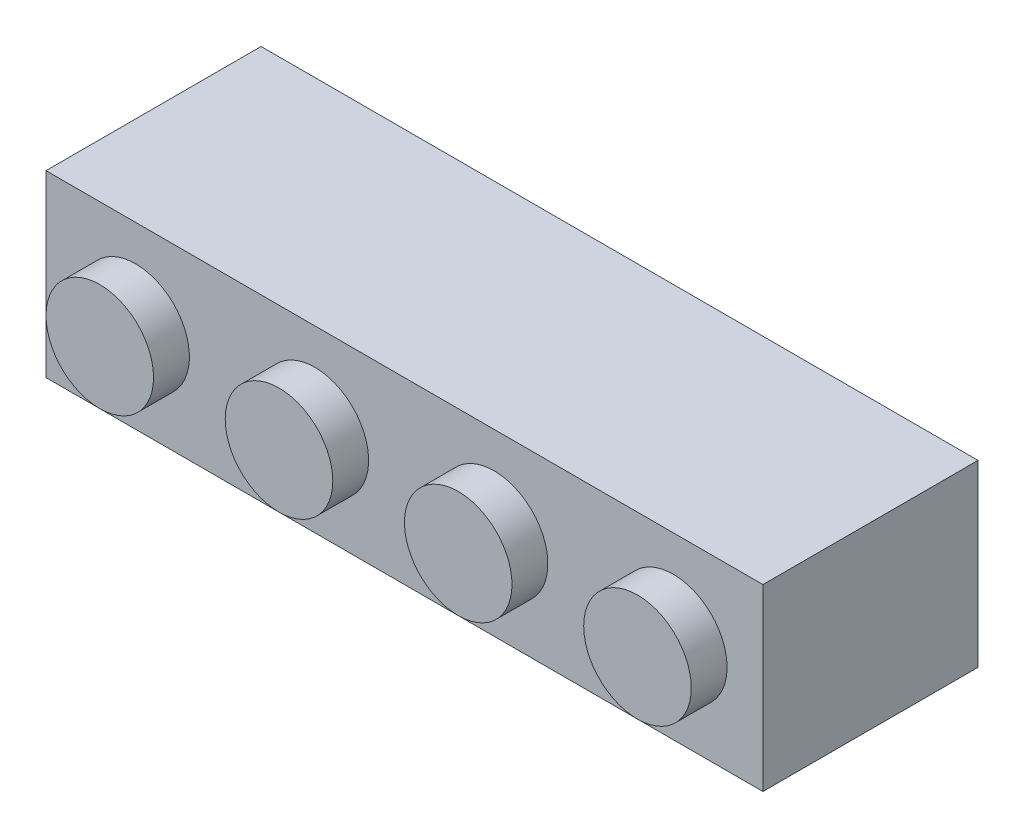
ISO-10303-21;
HEADER;
FILE_DESCRIPTION(('STEP AP214'),'2;1');
FILE_NAME('part.step','',(''),(''),'','','');
FILE_SCHEMA(('AUTOMOTIVE_DESIGN { 1 0 10303 214 1 1 1 1 }'));
ENDSEC;
DATA;
#1=APPLICATION_CONTEXT('core data for automotive mechanical design processes');
#2=APPLICATION_PROTOCOL_DEFINITION('international standard','automotive_design',2000,#1);
#3=PRODUCT_CONTEXT('',#1,'mechanical');
#4=PRODUCT('Part','Part','',(#3));
#5=PRODUCT_RELATED_PRODUCT_CATEGORY('part','',(#4));
#6=PRODUCT_DEFINITION_FORMATION('','',#4);
#7=PRODUCT_DEFINITION_CONTEXT('part definition',#1,'design');
#8=PRODUCT_DEFINITION('design','',#6,#7);
#9=PRODUCT_DEFINITION_SHAPE('','',#8);
#10=(LENGTH_UNIT() NAMED_UNIT(*) SI_UNIT(.MILLI.,.METRE.));
#11=(NAMED_UNIT(*) PLANE_ANGLE_UNIT() SI_UNIT($,.RADIAN.));
#12=(NAMED_UNIT(*) SI_UNIT($,.STERADIAN.) SOLID_ANGLE_UNIT());
#13=UNCERTAINTY_MEASURE_WITH_UNIT(LENGTH_MEASURE(1.E-05),#10,'distance_accuracy_value','');
#14=(GEOMETRIC_REPRESENTATION_CONTEXT(3) GLOBAL_UNCERTAINTY_ASSIGNED_CONTEXT((#13)) GLOBAL_UNIT_ASSIGNED_CONTEXT((#10,
#11,#12)) REPRESENTATION_CONTEXT('',''));
#15=CARTESIAN_POINT('',(0.,0.,0.));
#16=DIRECTION('',(0.,0.,1.));
#17=DIRECTION('',(1.,0.,0.));
#18=AXIS2_PLACEMENT_3D('',#15,#16,#17);
#19=CARTESIAN_POINT('',(0.,0.,8.));
#20=DIRECTION('',(0.,0.,-1.));
#21=DIRECTION('',(-1.,0.,0.));
#22=AXIS2_PLACEMENT_3D('',#19,#20,#21);
#23=PLANE('',#22);
#24=CARTESIAN_POINT('',(16.,4.,8.));
#25=DIRECTION('',(0.,0.,-1.));
#26=DIRECTION('',(-1.,0.,0.));
#27=AXIS2_PLACEMENT_3D('',#24,#25,#26);
#28=CIRCLE('',#27,1.6);
#29=CARTESIAN_POINT('',(14.4,4.,8.));
#30=VERTEX_POINT('',#29);
#31=EDGE_CURVE('E516',#30,#30,#28,.T.);
#32=ORIENTED_EDGE('',*,*,#31,.F.);
#33=EDGE_LOOP('',(#32));
#34=FACE_BOUND('',#33,.T.);
#35=CARTESIAN_POINT('',(28.,4.,8.));
#36=DIRECTION('',(0.,0.,-1.));
#37=DIRECTION('',(-1.,0.,0.));
#38=AXIS2_PLACEMENT_3D('',#35,#36,#37);
#39=CIRCLE('',#38,0.800000000000001);
#40=CARTESIAN_POINT('',(27.2,4.,8.));
#41=VERTEX_POINT('',#40);
#42=EDGE_CURVE('E141',#41,#41,#39,.F.);
#43=ORIENTED_EDGE('',*,*,#42,.T.);
#44=EDGE_LOOP('',(#43));
#45=FACE_BOUND('',#44,.T.);
#46=CARTESIAN_POINT('',(20.,4.,8.));
#47=DIRECTION('',(0.,0.,-1.));
#48=DIRECTION('',(-1.,0.,0.));
#49=AXIS2_PLACEMENT_3D('',#46,#47,#48);
#50=CIRCLE('',#49,0.800000000000001);
#51=CARTESIAN_POINT('',(19.2,4.,8.));
#52=VERTEX_POINT('',#51);
#53=EDGE_CURVE('E136',#52,#52,#50,.F.);
#54=ORIENTED_EDGE('',*,*,#53,.T.);
#55=EDGE_LOOP('',(#54));
#56=FACE_BOUND('',#55,.T.);
#57=CARTESIAN_POINT('',(12.,4.,8.));
#58=DIRECTION('',(0.,0.,-1.));
#59=DIRECTION('',(-1.,0.,0.));
#60=AXIS2_PLACEMENT_3D('',#57,#58,#59);
#61=CIRCLE('',#60,0.800000000000001);
#62=CARTESIAN_POINT('',(11.2,4.,8.));
#63=VERTEX_POINT('',#62);
#64=EDGE_CURVE('E133',#63,#63,#61,.F.);
#65=ORIENTED_EDGE('',*,*,#64,.T.);
#66=EDGE_LOOP('',(#65));
#67=FACE_BOUND('',#66,.T.);
#68=DIRECTION('',(0.,-1.,0.));
#69=VECTOR('',#68,1.);
#70=CARTESIAN_POINT('',(1.6,0.,8.));
#71=LINE('',#70,#69);
#72=CARTESIAN_POINT('',(1.6,6.4,8.));
#73=VERTEX_POINT('',#72);
#74=CARTESIAN_POINT('',(1.6,1.6,8.));
#75=VERTEX_POINT('',#74);
#76=EDGE_CURVE('E119',#73,#75,#71,.T.);
#77=ORIENTED_EDGE('',*,*,#76,.F.);
#78=DIRECTION('',(-1.,0.,0.));
#79=VECTOR('',#78,1.);
#80=CARTESIAN_POINT('',(0.,6.4,8.));
#81=LINE('',#80,#79);
#82=CARTESIAN_POINT('',(30.4,6.4,8.));
#83=VERTEX_POINT('',#82);
#84=EDGE_CURVE('E127',#83,#73,#81,.T.);
#85=ORIENTED_EDGE('',*,*,#84,.F.);
#86=DIRECTION('',(0.,1.,0.));
#87=VECTOR('',#86,1.);
#88=CARTESIAN_POINT('',(30.4,0.,8.));
#89=LINE('',#88,#87);
#90=CARTESIAN_POINT('',(30.4,1.6,8.));
#91=VERTEX_POINT('',#90);
#92=EDGE_CURVE('E118',#91,#83,#89,.T.);
#93=ORIENTED_EDGE('',*,*,#92,.F.);
#94=DIRECTION('',(1.,0.,0.));
#95=VECTOR('',#94,1.);
#96=CARTESIAN_POINT('',(0.,1.6,8.));
#97=LINE('',#96,#95);
#98=EDGE_CURVE('E108',#75,#91,#97,.T.);
#99=ORIENTED_EDGE('',*,*,#98,.F.);
#100=EDGE_LOOP('',(#77,#85,#93,#99));
#101=FACE_BOUND('',#100,.T.);
#102=CARTESIAN_POINT('',(4.,4.,8.));
#103=DIRECTION('',(0.,0.,-1.));
#104=DIRECTION('',(-1.,0.,0.));
#105=AXIS2_PLACEMENT_3D('',#102,#103,#104);
#106=CIRCLE('',#105,0.800000000000001);
#107=CARTESIAN_POINT('',(3.2,4.,8.));
#108=VERTEX_POINT('',#107);
#109=EDGE_CURVE('E137',#108,#108,#106,.F.);
#110=ORIENTED_EDGE('',*,*,#109,.T.);
#111=EDGE_LOOP('',(#110));
#112=FACE_BOUND('',#111,.T.);
#113=CARTESIAN_POINT('',(8.,4.,8.));
#114=DIRECTION('',(0.,0.,-1.));
#115=DIRECTION('',(-1.,0.,0.));
#116=AXIS2_PLACEMENT_3D('',#113,#114,#115);
#117=CIRCLE('',#116,1.6);
#118=CARTESIAN_POINT('',(6.4,4.,8.));
#119=VERTEX_POINT('',#118);
#120=EDGE_CURVE('E527',#119,#119,#117,.T.);
#121=ORIENTED_EDGE('',*,*,#120,.F.);
#122=EDGE_LOOP('',(#121));
#123=FACE_BOUND('',#122,.T.);
#124=CARTESIAN_POINT('',(24.,4.,8.));
#125=DIRECTION('',(0.,0.,-1.));
#126=DIRECTION('',(-1.,0.,0.));
#127=AXIS2_PLACEMENT_3D('',#124,#125,#126);
#128=CIRCLE('',#127,1.6);
#129=CARTESIAN_POINT('',(22.4,4.,8.));
#130=VERTEX_POINT('',#129);
#131=EDGE_CURVE('E517',#130,#130,#128,.T.);
#132=ORIENTED_EDGE('',*,*,#131,.F.);
#133=EDGE_LOOP('',(#132));
#134=FACE_BOUND('',#133,.T.);
#135=ADVANCED_FACE('F33',(#34,#45,#56,#67,#101,#112,#123,#134),#23,.T.);
#136=CARTESIAN_POINT('',(0.,0.,0.));
#137=DIRECTION('',(0.,0.,-1.));
#138=DIRECTION('',(-1.,0.,0.));
#139=AXIS2_PLACEMENT_3D('',#136,#137,#138);
#140=PLANE('',#139);
#141=DIRECTION('',(0.,-1.,0.));
#142=VECTOR('',#141,1.);
#143=CARTESIAN_POINT('',(0.,0.,0.));
#144=LINE('',#143,#142);
#145=CARTESIAN_POINT('',(0.,8.,0.));
#146=VERTEX_POINT('',#145);
#147=CARTESIAN_POINT('',(0.,0.,0.));
#148=VERTEX_POINT('',#147);
#149=EDGE_CURVE('E174',#146,#148,#144,.T.);
#150=ORIENTED_EDGE('',*,*,#149,.F.);
#151=DIRECTION('',(-1.,0.,0.));
#152=VECTOR('',#151,1.);
#153=CARTESIAN_POINT('',(0.,8.,0.));
#154=LINE('',#153,#152);
#155=CARTESIAN_POINT('',(32.,8.,0.));
#156=VERTEX_POINT('',#155);
#157=EDGE_CURVE('E78',#156,#146,#154,.T.);
#158=ORIENTED_EDGE('',*,*,#157,.F.);
#159=DIRECTION('',(0.,1.,0.));
#160=VECTOR('',#159,1.);
#161=CARTESIAN_POINT('',(32.,0.,0.));
#162=LINE('',#161,#160);
#163=CARTESIAN_POINT('',(32.,0.,0.));
#164=VERTEX_POINT('',#163);
#165=EDGE_CURVE('E186',#164,#156,#162,.T.);
#166=ORIENTED_EDGE('',*,*,#165,.F.);
#167=DIRECTION('',(1.,0.,0.));
#168=VECTOR('',#167,1.);
#169=CARTESIAN_POINT('',(0.,0.,0.));
#170=LINE('',#169,#168);
#171=EDGE_CURVE('E184',#148,#164,#170,.T.);
#172=ORIENTED_EDGE('',*,*,#171,.F.);
#173=EDGE_LOOP('',(#150,#158,#166,#172));
#174=FACE_BOUND('',#173,.T.);
#175=DIRECTION('',(-1.,0.,0.));
#176=VECTOR('',#175,1.);
#177=CARTESIAN_POINT('',(0.,6.4,0.));
#178=LINE('',#177,#176);
#179=CARTESIAN_POINT('',(30.4,6.4,0.));
#180=VERTEX_POINT('',#179);
#181=CARTESIAN_POINT('',(1.6,6.4,0.));
#182=VERTEX_POINT('',#181);
#183=EDGE_CURVE('E164',#180,#182,#178,.T.);
#184=ORIENTED_EDGE('',*,*,#183,.T.);
#185=DIRECTION('',(0.,-1.,0.));
#186=VECTOR('',#185,1.);
#187=CARTESIAN_POINT('',(1.6,0.,0.));
#188=LINE('',#187,#186);
#189=CARTESIAN_POINT('',(1.6,1.6,0.));
#190=VERTEX_POINT('',#189);
#191=EDGE_CURVE('E151',#182,#190,#188,.T.);
#192=ORIENTED_EDGE('',*,*,#191,.T.);
#193=DIRECTION('',(1.,0.,0.));
#194=VECTOR('',#193,1.);
#195=CARTESIAN_POINT('',(0.,1.6,0.));
#196=LINE('',#195,#194);
#197=CARTESIAN_POINT('',(30.4,1.6,0.));
#198=VERTEX_POINT('',#197);
#199=EDGE_CURVE('E163',#190,#198,#196,.T.);
#200=ORIENTED_EDGE('',*,*,#199,.T.);
#201=DIRECTION('',(0.,1.,0.));
#202=VECTOR('',#201,1.);
#203=CARTESIAN_POINT('',(30.4,0.,0.));
#204=LINE('',#203,#202);
#205=EDGE_CURVE('E48',#198,#180,#204,.T.);
#206=ORIENTED_EDGE('',*,*,#205,.T.);
#207=EDGE_LOOP('',(#184,#192,#200,#206));
#208=FACE_BOUND('',#207,.T.);
#209=ADVANCED_FACE('F216',(#174,#208),#140,.T.);
#210=CARTESIAN_POINT('',(0.,0.,9.6));
#211=DIRECTION('',(0.,0.,-1.));
#212=DIRECTION('',(-1.,0.,0.));
#213=AXIS2_PLACEMENT_3D('',#210,#211,#212);
#214=PLANE('',#213);
#215=CARTESIAN_POINT('',(4.,4.,9.6));
#216=DIRECTION('',(0.,0.,-1.));
#217=DIRECTION('',(-1.,0.,0.));
#218=AXIS2_PLACEMENT_3D('',#215,#216,#217);
#219=CIRCLE('',#218,2.4);
#220=CARTESIAN_POINT('',(1.6,4.,9.6));
#221=VERTEX_POINT('',#220);
#222=EDGE_CURVE('E197',#221,#221,#219,.F.);
#223=ORIENTED_EDGE('',*,*,#222,.F.);
#224=EDGE_LOOP('',(#223));
#225=FACE_BOUND('',#224,.T.);
#226=DIRECTION('',(0.,-1.,0.));
#227=VECTOR('',#226,1.);
#228=CARTESIAN_POINT('',(0.,0.,9.6));
#229=LINE('',#228,#227);
#230=CARTESIAN_POINT('',(0.,8.,9.6));
#231=VERTEX_POINT('',#230);
#232=CARTESIAN_POINT('',(0.,0.,9.6));
#233=VERTEX_POINT('',#232);
#234=EDGE_CURVE('E175',#231,#233,#229,.T.);
#235=ORIENTED_EDGE('',*,*,#234,.T.);
#236=DIRECTION('',(1.,0.,0.));
#237=VECTOR('',#236,1.);
#238=CARTESIAN_POINT('',(0.,0.,9.6));
#239=LINE('',#238,#237);
#240=CARTESIAN_POINT('',(32.,0.,9.6));
#241=VERTEX_POINT('',#240);
#242=EDGE_CURVE('E86',#233,#241,#239,.T.);
#243=ORIENTED_EDGE('',*,*,#242,.T.);
#244=DIRECTION('',(0.,1.,0.));
#245=VECTOR('',#244,1.);
#246=CARTESIAN_POINT('',(32.,0.,9.6));
#247=LINE('',#246,#245);
#248=CARTESIAN_POINT('',(32.,8.,9.6));
#249=VERTEX_POINT('',#248);
#250=EDGE_CURVE('E178',#241,#249,#247,.T.);
#251=ORIENTED_EDGE('',*,*,#250,.T.);
#252=DIRECTION('',(-1.,0.,0.));
#253=VECTOR('',#252,1.);
#254=CARTESIAN_POINT('',(0.,8.,9.6));
#255=LINE('',#254,#253);
#256=EDGE_CURVE('E57',#249,#231,#255,.T.);
#257=ORIENTED_EDGE('',*,*,#256,.T.);
#258=EDGE_LOOP('',(#235,#243,#251,#257));
#259=FACE_BOUND('',#258,.T.);
#260=CARTESIAN_POINT('',(12.,4.,9.6));
#261=DIRECTION('',(0.,0.,-1.));
#262=DIRECTION('',(-1.,0.,0.));
#263=AXIS2_PLACEMENT_3D('',#260,#261,#262);
#264=CIRCLE('',#263,2.4);
#265=CARTESIAN_POINT('',(9.6,4.,9.6));
#266=VERTEX_POINT('',#265);
#267=EDGE_CURVE('E200',#266,#266,#264,.F.);
#268=ORIENTED_EDGE('',*,*,#267,.F.);
#269=EDGE_LOOP('',(#268));
#270=FACE_BOUND('',#269,.T.);
#271=CARTESIAN_POINT('',(20.,4.,9.6));
#272=DIRECTION('',(0.,0.,-1.));
#273=DIRECTION('',(-1.,0.,0.));
#274=AXIS2_PLACEMENT_3D('',#271,#272,#273);
#275=CIRCLE('',#274,2.4);
#276=CARTESIAN_POINT('',(17.6,4.,9.6));
#277=VERTEX_POINT('',#276);
#278=EDGE_CURVE('E203',#277,#277,#275,.F.);
#279=ORIENTED_EDGE('',*,*,#278,.F.);
#280=EDGE_LOOP('',(#279));
#281=FACE_BOUND('',#280,.T.);
#282=CARTESIAN_POINT('',(28.,4.,9.6));
#283=DIRECTION('',(0.,0.,-1.));
#284=DIRECTION('',(-1.,0.,0.));
#285=AXIS2_PLACEMENT_3D('',#282,#283,#284);
#286=CIRCLE('',#285,2.4);
#287=CARTESIAN_POINT('',(25.6,4.,9.6));
#288=VERTEX_POINT('',#287);
#289=EDGE_CURVE('E41',#288,#288,#286,.F.);
#290=ORIENTED_EDGE('',*,*,#289,.F.);
#291=EDGE_LOOP('',(#290));
#292=FACE_BOUND('',#291,.T.);
#293=ADVANCED_FACE('F213',(#225,#259,#270,#281,#292),#214,.F.);
#294=CARTESIAN_POINT('',(0.,0.,9.6));
#295=DIRECTION('',(1.,0.,0.));
#296=DIRECTION('',(0.,0.,-1.));
#297=AXIS2_PLACEMENT_3D('',#294,#295,#296);
#298=PLANE('',#297);
#299=ORIENTED_EDGE('',*,*,#149,.T.);
#300=DIRECTION('',(0.,0.,-1.));
#301=VECTOR('',#300,1.);
#302=CARTESIAN_POINT('',(0.,0.,9.6));
#303=LINE('',#302,#301);
#304=EDGE_CURVE('E195',#233,#148,#303,.T.);
#305=ORIENTED_EDGE('',*,*,#304,.F.);
#306=ORIENTED_EDGE('',*,*,#234,.F.);
#307=DIRECTION('',(0.,0.,-1.));
#308=VECTOR('',#307,1.);
#309=CARTESIAN_POINT('',(0.,8.,9.6));
#310=LINE('',#309,#308);
#311=EDGE_CURVE('E181',#231,#146,#310,.T.);
#312=ORIENTED_EDGE('',*,*,#311,.T.);
#313=EDGE_LOOP('',(#299,#305,#306,#312));
#314=FACE_BOUND('',#313,.T.);
#315=ADVANCED_FACE('F215',(#314),#298,.F.);
#316=CARTESIAN_POINT('',(0.,0.,9.6));
#317=DIRECTION('',(0.,1.,0.));
#318=DIRECTION('',(0.,0.,1.));
#319=AXIS2_PLACEMENT_3D('',#316,#317,#318);
#320=PLANE('',#319);
#321=ORIENTED_EDGE('',*,*,#171,.T.);
#322=DIRECTION('',(0.,0.,-1.));
#323=VECTOR('',#322,1.);
#324=CARTESIAN_POINT('',(32.,0.,9.6));
#325=LINE('',#324,#323);
#326=EDGE_CURVE('E192',#241,#164,#325,.T.);
#327=ORIENTED_EDGE('',*,*,#326,.F.);
#328=ORIENTED_EDGE('',*,*,#242,.F.);
#329=ORIENTED_EDGE('',*,*,#304,.T.);
#330=EDGE_LOOP('',(#321,#327,#328,#329));
#331=FACE_BOUND('',#330,.T.);
#332=ADVANCED_FACE('F223',(#331),#320,.F.);
#333=CARTESIAN_POINT('',(32.,0.,9.6));
#334=DIRECTION('',(-1.,0.,0.));
#335=DIRECTION('',(0.,0.,1.));
#336=AXIS2_PLACEMENT_3D('',#333,#334,#335);
#337=PLANE('',#336);
#338=ORIENTED_EDGE('',*,*,#165,.T.);
#339=DIRECTION('',(0.,0.,-1.));
#340=VECTOR('',#339,1.);
#341=CARTESIAN_POINT('',(32.,8.,9.6));
#342=LINE('',#341,#340);
#343=EDGE_CURVE('E190',#249,#156,#342,.T.);
#344=ORIENTED_EDGE('',*,*,#343,.F.);
#345=ORIENTED_EDGE('',*,*,#250,.F.);
#346=ORIENTED_EDGE('',*,*,#326,.T.);
#347=EDGE_LOOP('',(#338,#344,#345,#346));
#348=FACE_BOUND('',#347,.T.);
#349=ADVANCED_FACE('F304',(#348),#337,.F.);
#350=CARTESIAN_POINT('',(0.,8.,9.6));
#351=DIRECTION('',(0.,-1.,0.));
#352=DIRECTION('',(0.,0.,-1.));
#353=AXIS2_PLACEMENT_3D('',#350,#351,#352);
#354=PLANE('',#353);
#355=ORIENTED_EDGE('',*,*,#157,.T.);
#356=ORIENTED_EDGE('',*,*,#311,.F.);
#357=ORIENTED_EDGE('',*,*,#256,.F.);
#358=ORIENTED_EDGE('',*,*,#343,.T.);
#359=EDGE_LOOP('',(#355,#356,#357,#358));
#360=FACE_BOUND('',#359,.T.);
#361=ADVANCED_FACE('F299',(#360),#354,.F.);
#362=CARTESIAN_POINT('',(4.,4.,11.2));
#363=DIRECTION('',(0.,0.,-1.));
#364=DIRECTION('',(-1.,0.,0.));
#365=AXIS2_PLACEMENT_3D('',#362,#363,#364);
#366=CYLINDRICAL_SURFACE('',#365,2.4);
#367=CARTESIAN_POINT('',(4.,4.,11.2));
#368=DIRECTION('',(0.,0.,1.));
#369=DIRECTION('',(1.,0.,0.));
#370=AXIS2_PLACEMENT_3D('',#367,#368,#369);
#371=CIRCLE('',#370,2.4);
#372=CARTESIAN_POINT('',(6.4,4.,11.2));
#373=VERTEX_POINT('',#372);
#374=EDGE_CURVE('E171',#373,#373,#371,.T.);
#375=ORIENTED_EDGE('',*,*,#374,.F.);
#376=EDGE_LOOP('',(#375));
#377=FACE_BOUND('',#376,.T.);
#378=ORIENTED_EDGE('',*,*,#222,.T.);
#379=EDGE_LOOP('',(#378));
#380=FACE_BOUND('',#379,.T.);
#381=ADVANCED_FACE('F296',(#377,#380),#366,.T.);
#382=CARTESIAN_POINT('',(4.,4.,11.2));
#383=DIRECTION('',(0.,0.,1.));
#384=DIRECTION('',(1.,0.,0.));
#385=AXIS2_PLACEMENT_3D('',#382,#383,#384);
#386=PLANE('',#385);
#387=ORIENTED_EDGE('',*,*,#374,.T.);
#388=EDGE_LOOP('',(#387));
#389=FACE_BOUND('',#388,.T.);
#390=ADVANCED_FACE('F293',(#389),#386,.T.);
#391=CARTESIAN_POINT('',(12.,4.,11.2));
#392=DIRECTION('',(0.,0.,-1.));
#393=DIRECTION('',(-1.,0.,0.));
#394=AXIS2_PLACEMENT_3D('',#391,#392,#393);
#395=CYLINDRICAL_SURFACE('',#394,2.4);
#396=CARTESIAN_POINT('',(12.,4.,11.2));
#397=DIRECTION('',(0.,0.,1.));
#398=DIRECTION('',(1.,0.,0.));
#399=AXIS2_PLACEMENT_3D('',#396,#397,#398);
#400=CIRCLE('',#399,2.4);
#401=CARTESIAN_POINT('',(14.4,4.,11.2));
#402=VERTEX_POINT('',#401);
#403=EDGE_CURVE('E160',#402,#402,#400,.T.);
#404=ORIENTED_EDGE('',*,*,#403,.F.);
#405=EDGE_LOOP('',(#404));
#406=FACE_BOUND('',#405,.T.);
#407=ORIENTED_EDGE('',*,*,#267,.T.);
#408=EDGE_LOOP('',(#407));
#409=FACE_BOUND('',#408,.T.);
#410=ADVANCED_FACE('F289',(#406,#409),#395,.T.);
#411=CARTESIAN_POINT('',(12.,4.,11.2));
#412=DIRECTION('',(0.,0.,1.));
#413=DIRECTION('',(1.,0.,0.));
#414=AXIS2_PLACEMENT_3D('',#411,#412,#413);
#415=PLANE('',#414);
#416=ORIENTED_EDGE('',*,*,#403,.T.);
#417=EDGE_LOOP('',(#416));
#418=FACE_BOUND('',#417,.T.);
#419=ADVANCED_FACE('F285',(#418),#415,.T.);
#420=CARTESIAN_POINT('',(20.,4.,11.2));
#421=DIRECTION('',(0.,0.,1.));
#422=DIRECTION('',(1.,0.,0.));
#423=AXIS2_PLACEMENT_3D('',#420,#421,#422);
#424=PLANE('',#423);
#425=CARTESIAN_POINT('',(20.,4.,11.2));
#426=DIRECTION('',(0.,0.,1.));
#427=DIRECTION('',(1.,0.,0.));
#428=AXIS2_PLACEMENT_3D('',#425,#426,#427);
#429=CIRCLE('',#428,2.4);
#430=CARTESIAN_POINT('',(22.4,4.,11.2));
#431=VERTEX_POINT('',#430);
#432=EDGE_CURVE('E206',#431,#431,#429,.T.);
#433=ORIENTED_EDGE('',*,*,#432,.T.);
#434=EDGE_LOOP('',(#433));
#435=FACE_BOUND('',#434,.T.);
#436=ADVANCED_FACE('F288',(#435),#424,.T.);
#437=CARTESIAN_POINT('',(20.,4.,11.2));
#438=DIRECTION('',(0.,0.,-1.));
#439=DIRECTION('',(-1.,0.,0.));
#440=AXIS2_PLACEMENT_3D('',#437,#438,#439);
#441=CYLINDRICAL_SURFACE('',#440,2.4);
#442=ORIENTED_EDGE('',*,*,#432,.F.);
#443=EDGE_LOOP('',(#442));
#444=FACE_BOUND('',#443,.T.);
#445=ORIENTED_EDGE('',*,*,#278,.T.);
#446=EDGE_LOOP('',(#445));
#447=FACE_BOUND('',#446,.T.);
#448=ADVANCED_FACE('F316',(#444,#447),#441,.T.);
#449=CARTESIAN_POINT('',(28.,4.,11.2));
#450=DIRECTION('',(0.,0.,1.));
#451=DIRECTION('',(1.,0.,0.));
#452=AXIS2_PLACEMENT_3D('',#449,#450,#451);
#453=PLANE('',#452);
#454=CARTESIAN_POINT('',(28.,4.,11.2));
#455=DIRECTION('',(0.,0.,1.));
#456=DIRECTION('',(1.,0.,0.));
#457=AXIS2_PLACEMENT_3D('',#454,#455,#456);
#458=CIRCLE('',#457,2.4);
#459=CARTESIAN_POINT('',(30.4,4.,11.2));
#460=VERTEX_POINT('',#459);
#461=EDGE_CURVE('E11',#460,#460,#458,.T.);
#462=ORIENTED_EDGE('',*,*,#461,.T.);
#463=EDGE_LOOP('',(#462));
#464=FACE_BOUND('',#463,.T.);
#465=ADVANCED_FACE('F35',(#464),#453,.T.);
#466=CARTESIAN_POINT('',(28.,4.,11.2));
#467=DIRECTION('',(0.,0.,-1.));
#468=DIRECTION('',(-1.,0.,0.));
#469=AXIS2_PLACEMENT_3D('',#466,#467,#468);
#470=CYLINDRICAL_SURFACE('',#469,2.4);
#471=ORIENTED_EDGE('',*,*,#461,.F.);
#472=EDGE_LOOP('',(#471));
#473=FACE_BOUND('',#472,.T.);
#474=ORIENTED_EDGE('',*,*,#289,.T.);
#475=EDGE_LOOP('',(#474));
#476=FACE_BOUND('',#475,.T.);
#477=ADVANCED_FACE('F211',(#473,#476),#470,.T.);
#478=CARTESIAN_POINT('',(1.6,0.,9.6));
#479=DIRECTION('',(1.,0.,0.));
#480=DIRECTION('',(0.,0.,-1.));
#481=AXIS2_PLACEMENT_3D('',#478,#479,#480);
#482=PLANE('',#481);
#483=ORIENTED_EDGE('',*,*,#191,.F.);
#484=DIRECTION('',(0.,0.,-1.));
#485=VECTOR('',#484,1.);
#486=CARTESIAN_POINT('',(1.6,6.4,9.6));
#487=LINE('',#486,#485);
#488=EDGE_CURVE('E129',#73,#182,#487,.T.);
#489=ORIENTED_EDGE('',*,*,#488,.F.);
#490=ORIENTED_EDGE('',*,*,#76,.T.);
#491=DIRECTION('',(0.,0.,-1.));
#492=VECTOR('',#491,1.);
#493=CARTESIAN_POINT('',(1.6,1.6,9.6));
#494=LINE('',#493,#492);
#495=EDGE_CURVE('E113',#75,#190,#494,.T.);
#496=ORIENTED_EDGE('',*,*,#495,.T.);
#497=EDGE_LOOP('',(#483,#489,#490,#496));
#498=FACE_BOUND('',#497,.T.);
#499=ADVANCED_FACE('F241',(#498),#482,.T.);
#500=CARTESIAN_POINT('',(0.,1.6,9.6));
#501=DIRECTION('',(0.,1.,0.));
#502=DIRECTION('',(0.,0.,1.));
#503=AXIS2_PLACEMENT_3D('',#500,#501,#502);
#504=PLANE('',#503);
#505=ORIENTED_EDGE('',*,*,#199,.F.);
#506=ORIENTED_EDGE('',*,*,#495,.F.);
#507=ORIENTED_EDGE('',*,*,#98,.T.);
#508=DIRECTION('',(0.,0.,-1.));
#509=VECTOR('',#508,1.);
#510=CARTESIAN_POINT('',(30.4,1.6,9.6));
#511=LINE('',#510,#509);
#512=EDGE_CURVE('E110',#91,#198,#511,.T.);
#513=ORIENTED_EDGE('',*,*,#512,.T.);
#514=EDGE_LOOP('',(#505,#506,#507,#513));
#515=FACE_BOUND('',#514,.T.);
#516=ADVANCED_FACE('F109',(#515),#504,.T.);
#517=CARTESIAN_POINT('',(30.4,0.,9.6));
#518=DIRECTION('',(-1.,0.,0.));
#519=DIRECTION('',(0.,0.,1.));
#520=AXIS2_PLACEMENT_3D('',#517,#518,#519);
#521=PLANE('',#520);
#522=ORIENTED_EDGE('',*,*,#205,.F.);
#523=ORIENTED_EDGE('',*,*,#512,.F.);
#524=ORIENTED_EDGE('',*,*,#92,.T.);
#525=DIRECTION('',(0.,0.,-1.));
#526=VECTOR('',#525,1.);
#527=CARTESIAN_POINT('',(30.4,6.4,9.6));
#528=LINE('',#527,#526);
#529=EDGE_CURVE('E123',#83,#180,#528,.T.);
#530=ORIENTED_EDGE('',*,*,#529,.T.);
#531=EDGE_LOOP('',(#522,#523,#524,#530));
#532=FACE_BOUND('',#531,.T.);
#533=ADVANCED_FACE('F121',(#532),#521,.T.);
#534=CARTESIAN_POINT('',(0.,6.4,9.6));
#535=DIRECTION('',(0.,-1.,0.));
#536=DIRECTION('',(0.,0.,-1.));
#537=AXIS2_PLACEMENT_3D('',#534,#535,#536);
#538=PLANE('',#537);
#539=ORIENTED_EDGE('',*,*,#183,.F.);
#540=ORIENTED_EDGE('',*,*,#529,.F.);
#541=ORIENTED_EDGE('',*,*,#84,.T.);
#542=ORIENTED_EDGE('',*,*,#488,.T.);
#543=EDGE_LOOP('',(#539,#540,#541,#542));
#544=FACE_BOUND('',#543,.T.);
#545=ADVANCED_FACE('F249',(#544),#538,.T.);
#546=CARTESIAN_POINT('',(4.,4.,11.2));
#547=DIRECTION('',(0.,0.,-1.));
#548=DIRECTION('',(-1.,0.,0.));
#549=AXIS2_PLACEMENT_3D('',#546,#547,#548);
#550=CYLINDRICAL_SURFACE('',#549,0.800000000000001);
#551=CARTESIAN_POINT('',(4.,4.,9.6));
#552=DIRECTION('',(0.,0.,1.));
#553=DIRECTION('',(1.,0.,0.));
#554=AXIS2_PLACEMENT_3D('',#551,#552,#553);
#555=CIRCLE('',#554,0.800000000000001);
#556=CARTESIAN_POINT('',(4.8,4.,9.6));
#557=VERTEX_POINT('',#556);
#558=EDGE_CURVE('E148',#557,#557,#555,.T.);
#559=ORIENTED_EDGE('',*,*,#558,.T.);
#560=EDGE_LOOP('',(#559));
#561=FACE_BOUND('',#560,.T.);
#562=ORIENTED_EDGE('',*,*,#109,.F.);
#563=EDGE_LOOP('',(#562));
#564=FACE_BOUND('',#563,.T.);
#565=ADVANCED_FACE('F252',(#561,#564),#550,.F.);
#566=CARTESIAN_POINT('',(4.,4.,9.6));
#567=DIRECTION('',(0.,0.,1.));
#568=DIRECTION('',(1.,0.,0.));
#569=AXIS2_PLACEMENT_3D('',#566,#567,#568);
#570=PLANE('',#569);
#571=ORIENTED_EDGE('',*,*,#558,.F.);
#572=EDGE_LOOP('',(#571));
#573=FACE_BOUND('',#572,.T.);
#574=ADVANCED_FACE('F256',(#573),#570,.F.);
#575=CARTESIAN_POINT('',(12.,4.,11.2));
#576=DIRECTION('',(0.,0.,-1.));
#577=DIRECTION('',(-1.,0.,0.));
#578=AXIS2_PLACEMENT_3D('',#575,#576,#577);
#579=CYLINDRICAL_SURFACE('',#578,0.800000000000001);
#580=CARTESIAN_POINT('',(12.,4.,9.6));
#581=DIRECTION('',(0.,0.,1.));
#582=DIRECTION('',(1.,0.,0.));
#583=AXIS2_PLACEMENT_3D('',#580,#581,#582);
#584=CIRCLE('',#583,0.800000000000001);
#585=CARTESIAN_POINT('',(12.8,4.,9.6));
#586=VERTEX_POINT('',#585);
#587=EDGE_CURVE('E152',#586,#586,#584,.T.);
#588=ORIENTED_EDGE('',*,*,#587,.T.);
#589=EDGE_LOOP('',(#588));
#590=FACE_BOUND('',#589,.T.);
#591=ORIENTED_EDGE('',*,*,#64,.F.);
#592=EDGE_LOOP('',(#591));
#593=FACE_BOUND('',#592,.T.);
#594=ADVANCED_FACE('F260',(#590,#593),#579,.F.);
#595=CARTESIAN_POINT('',(12.,4.,9.6));
#596=DIRECTION('',(0.,0.,1.));
#597=DIRECTION('',(1.,0.,0.));
#598=AXIS2_PLACEMENT_3D('',#595,#596,#597);
#599=PLANE('',#598);
#600=ORIENTED_EDGE('',*,*,#587,.F.);
#601=EDGE_LOOP('',(#600));
#602=FACE_BOUND('',#601,.T.);
#603=ADVANCED_FACE('F264',(#602),#599,.F.);
#604=CARTESIAN_POINT('',(20.,4.,9.6));
#605=DIRECTION('',(0.,0.,1.));
#606=DIRECTION('',(1.,0.,0.));
#607=AXIS2_PLACEMENT_3D('',#604,#605,#606);
#608=PLANE('',#607);
#609=CARTESIAN_POINT('',(20.,4.,9.6));
#610=DIRECTION('',(0.,0.,1.));
#611=DIRECTION('',(1.,0.,0.));
#612=AXIS2_PLACEMENT_3D('',#609,#610,#611);
#613=CIRCLE('',#612,0.800000000000001);
#614=CARTESIAN_POINT('',(20.8,4.,9.6));
#615=VERTEX_POINT('',#614);
#616=EDGE_CURVE('E140',#615,#615,#613,.T.);
#617=ORIENTED_EDGE('',*,*,#616,.F.);
#618=EDGE_LOOP('',(#617));
#619=FACE_BOUND('',#618,.T.);
#620=ADVANCED_FACE('F268',(#619),#608,.F.);
#621=CARTESIAN_POINT('',(20.,4.,11.2));
#622=DIRECTION('',(0.,0.,-1.));
#623=DIRECTION('',(-1.,0.,0.));
#624=AXIS2_PLACEMENT_3D('',#621,#622,#623);
#625=CYLINDRICAL_SURFACE('',#624,0.800000000000001);
#626=ORIENTED_EDGE('',*,*,#616,.T.);
#627=EDGE_LOOP('',(#626));
#628=FACE_BOUND('',#627,.T.);
#629=ORIENTED_EDGE('',*,*,#53,.F.);
#630=EDGE_LOOP('',(#629));
#631=FACE_BOUND('',#630,.T.);
#632=ADVANCED_FACE('F272',(#628,#631),#625,.F.);
#633=CARTESIAN_POINT('',(28.,4.,9.6));
#634=DIRECTION('',(0.,0.,1.));
#635=DIRECTION('',(1.,0.,0.));
#636=AXIS2_PLACEMENT_3D('',#633,#634,#635);
#637=PLANE('',#636);
#638=CARTESIAN_POINT('',(28.,4.,9.6));
#639=DIRECTION('',(0.,0.,1.));
#640=DIRECTION('',(1.,0.,0.));
#641=AXIS2_PLACEMENT_3D('',#638,#639,#640);
#642=CIRCLE('',#641,0.800000000000001);
#643=CARTESIAN_POINT('',(28.8,4.,9.6));
#644=VERTEX_POINT('',#643);
#645=EDGE_CURVE('E144',#644,#644,#642,.T.);
#646=ORIENTED_EDGE('',*,*,#645,.F.);
#647=EDGE_LOOP('',(#646));
#648=FACE_BOUND('',#647,.T.);
#649=ADVANCED_FACE('F276',(#648),#637,.F.);
#650=CARTESIAN_POINT('',(28.,4.,11.2));
#651=DIRECTION('',(0.,0.,-1.));
#652=DIRECTION('',(-1.,0.,0.));
#653=AXIS2_PLACEMENT_3D('',#650,#651,#652);
#654=CYLINDRICAL_SURFACE('',#653,0.800000000000001);
#655=ORIENTED_EDGE('',*,*,#645,.T.);
#656=EDGE_LOOP('',(#655));
#657=FACE_BOUND('',#656,.T.);
#658=ORIENTED_EDGE('',*,*,#42,.F.);
#659=EDGE_LOOP('',(#658));
#660=FACE_BOUND('',#659,.T.);
#661=ADVANCED_FACE('F280',(#657,#660),#654,.F.);
#662=CARTESIAN_POINT('',(8.,4.,0.));
#663=DIRECTION('',(0.,0.,1.));
#664=DIRECTION('',(1.,0.,0.));
#665=AXIS2_PLACEMENT_3D('',#662,#663,#664);
#666=CYLINDRICAL_SURFACE('',#665,1.6);
#667=CARTESIAN_POINT('',(8.,4.,0.));
#668=DIRECTION('',(0.,0.,-1.));
#669=DIRECTION('',(-1.,0.,0.));
#670=AXIS2_PLACEMENT_3D('',#667,#668,#669);
#671=CIRCLE('',#670,1.6);
#672=CARTESIAN_POINT('',(6.4,4.,0.));
#673=VERTEX_POINT('',#672);
#674=EDGE_CURVE('E155',#673,#673,#671,.T.);
#675=ORIENTED_EDGE('',*,*,#674,.F.);
#676=EDGE_LOOP('',(#675));
#677=FACE_BOUND('',#676,.T.);
#678=ORIENTED_EDGE('',*,*,#120,.T.);
#679=EDGE_LOOP('',(#678));
#680=FACE_BOUND('',#679,.T.);
#681=ADVANCED_FACE('F239',(#677,#680),#666,.T.);
#682=CARTESIAN_POINT('',(8.,4.,0.));
#683=DIRECTION('',(0.,0.,-1.));
#684=DIRECTION('',(-1.,0.,0.));
#685=AXIS2_PLACEMENT_3D('',#682,#683,#684);
#686=PLANE('',#685);
#687=ORIENTED_EDGE('',*,*,#674,.T.);
#688=EDGE_LOOP('',(#687));
#689=FACE_BOUND('',#688,.T.);
#690=ADVANCED_FACE('F446',(#689),#686,.T.);
#691=CARTESIAN_POINT('',(16.,4.,0.));
#692=DIRECTION('',(0.,0.,1.));
#693=DIRECTION('',(1.,0.,0.));
#694=AXIS2_PLACEMENT_3D('',#691,#692,#693);
#695=CYLINDRICAL_SURFACE('',#694,1.6);
#696=CARTESIAN_POINT('',(16.,4.,0.));
#697=DIRECTION('',(0.,0.,-1.));
#698=DIRECTION('',(-1.,0.,0.));
#699=AXIS2_PLACEMENT_3D('',#696,#697,#698);
#700=CIRCLE('',#699,1.6);
#701=CARTESIAN_POINT('',(14.4,4.,0.));
#702=VERTEX_POINT('',#701);
#703=EDGE_CURVE('E520',#702,#702,#700,.T.);
#704=ORIENTED_EDGE('',*,*,#703,.F.);
#705=EDGE_LOOP('',(#704));
#706=FACE_BOUND('',#705,.T.);
#707=ORIENTED_EDGE('',*,*,#31,.T.);
#708=EDGE_LOOP('',(#707));
#709=FACE_BOUND('',#708,.T.);
#710=ADVANCED_FACE('F454',(#706,#709),#695,.T.);
#711=CARTESIAN_POINT('',(16.,4.,0.));
#712=DIRECTION('',(0.,0.,-1.));
#713=DIRECTION('',(-1.,0.,0.));
#714=AXIS2_PLACEMENT_3D('',#711,#712,#713);
#715=PLANE('',#714);
#716=ORIENTED_EDGE('',*,*,#703,.T.);
#717=EDGE_LOOP('',(#716));
#718=FACE_BOUND('',#717,.T.);
#719=ADVANCED_FACE('F466',(#718),#715,.T.);
#720=CARTESIAN_POINT('',(24.,4.,0.));
#721=DIRECTION('',(0.,0.,1.));
#722=DIRECTION('',(1.,0.,0.));
#723=AXIS2_PLACEMENT_3D('',#720,#721,#722);
#724=CYLINDRICAL_SURFACE('',#723,1.6);
#725=CARTESIAN_POINT('',(24.,4.,0.));
#726=DIRECTION('',(0.,0.,-1.));
#727=DIRECTION('',(-1.,0.,0.));
#728=AXIS2_PLACEMENT_3D('',#725,#726,#727);
#729=CIRCLE('',#728,1.6);
#730=CARTESIAN_POINT('',(22.4,4.,0.));
#731=VERTEX_POINT('',#730);
#732=EDGE_CURVE('E515',#731,#731,#729,.T.);
#733=ORIENTED_EDGE('',*,*,#732,.F.);
#734=EDGE_LOOP('',(#733));
#735=FACE_BOUND('',#734,.T.);
#736=ORIENTED_EDGE('',*,*,#131,.T.);
#737=EDGE_LOOP('',(#736));
#738=FACE_BOUND('',#737,.T.);
#739=ADVANCED_FACE('F475',(#735,#738),#724,.T.);
#740=CARTESIAN_POINT('',(24.,4.,0.));
#741=DIRECTION('',(0.,0.,-1.));
#742=DIRECTION('',(-1.,0.,0.));
#743=AXIS2_PLACEMENT_3D('',#740,#741,#742);
#744=PLANE('',#743);
#745=ORIENTED_EDGE('',*,*,#732,.T.);
#746=EDGE_LOOP('',(#745));
#747=FACE_BOUND('',#746,.T.);
#748=ADVANCED_FACE('F484',(#747),#744,.T.);
#749=CLOSED_SHELL('',(#135,#209,#293,#315,#332,#349,#361,#381,#390,#410,#419,#436,#448,#465,
#477,#499,#516,#533,#545,#565,#574,#594,#603,#620,#632,#649,#661,#681,#690,#710,#719,#739,#748));
#750=MANIFOLD_SOLID_BREP('B2',#749);
#751=ADVANCED_BREP_SHAPE_REPRESENTATION('',(#18,#750),#14);
#752=SHAPE_DEFINITION_REPRESENTATION(#9,#751);
ENDSEC;
END-ISO-10303-21;
